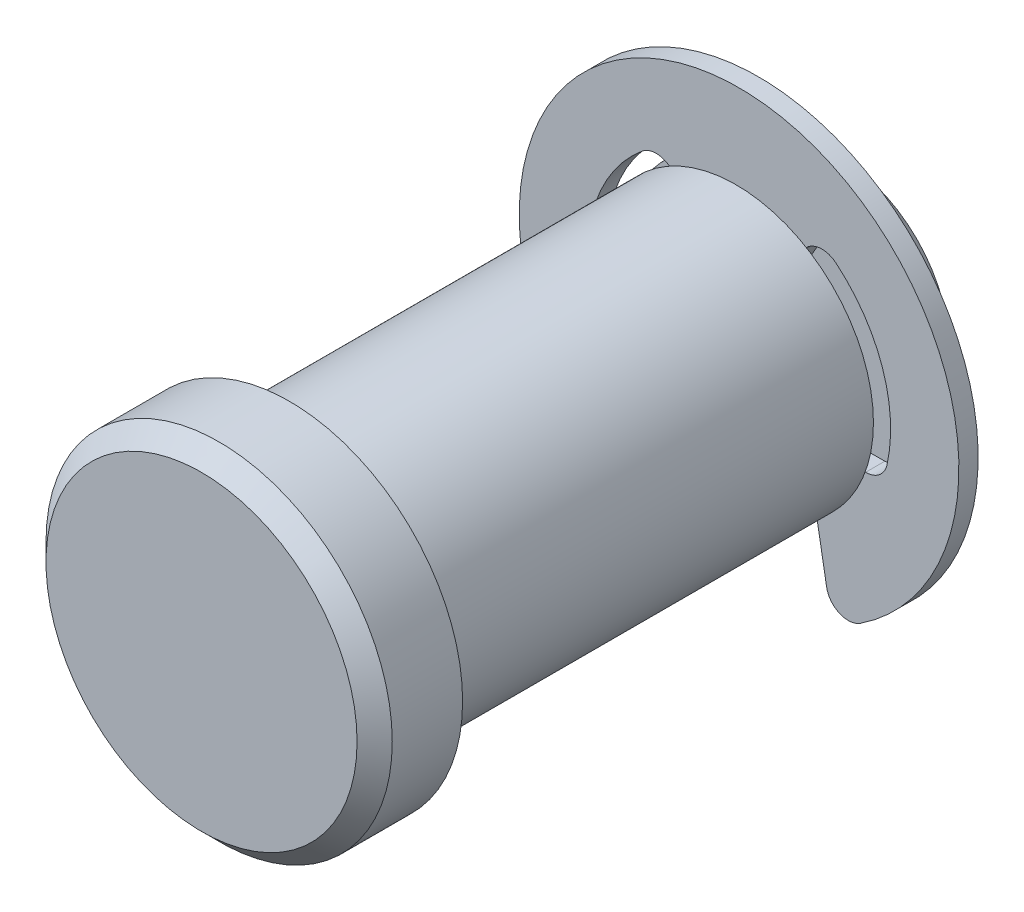
ISO-10303-21;
HEADER;
FILE_DESCRIPTION(('STEP AP214'),'2;1');
FILE_NAME('part.step','',(''),(''),'','','');
FILE_SCHEMA(('AUTOMOTIVE_DESIGN { 1 0 10303 214 1 1 1 1 }'));
ENDSEC;
DATA;
#1=APPLICATION_CONTEXT('core data for automotive mechanical design processes');
#2=APPLICATION_PROTOCOL_DEFINITION('international standard','automotive_design',2000,#1);
#3=PRODUCT_CONTEXT('',#1,'mechanical');
#4=PRODUCT('Part','Part','',(#3));
#5=PRODUCT_RELATED_PRODUCT_CATEGORY('part','',(#4));
#6=PRODUCT_DEFINITION_FORMATION('','',#4);
#7=PRODUCT_DEFINITION_CONTEXT('part definition',#1,'design');
#8=PRODUCT_DEFINITION('design','',#6,#7);
#9=PRODUCT_DEFINITION_SHAPE('','',#8);
#10=(LENGTH_UNIT() NAMED_UNIT(*) SI_UNIT(.MILLI.,.METRE.));
#11=(NAMED_UNIT(*) PLANE_ANGLE_UNIT() SI_UNIT($,.RADIAN.));
#12=(NAMED_UNIT(*) SI_UNIT($,.STERADIAN.) SOLID_ANGLE_UNIT());
#13=UNCERTAINTY_MEASURE_WITH_UNIT(LENGTH_MEASURE(1.E-05),#10,'distance_accuracy_value','');
#14=(GEOMETRIC_REPRESENTATION_CONTEXT(3) GLOBAL_UNCERTAINTY_ASSIGNED_CONTEXT((#13)) GLOBAL_UNIT_ASSIGNED_CONTEXT((#10,
#11,#12)) REPRESENTATION_CONTEXT('',''));
#15=CARTESIAN_POINT('',(0.,0.,0.));
#16=DIRECTION('',(0.,0.,1.));
#17=DIRECTION('',(1.,0.,0.));
#18=AXIS2_PLACEMENT_3D('',#15,#16,#17);
#19=CARTESIAN_POINT('',(0.,0.,-8.0772));
#20=DIRECTION('',(0.,0.,1.));
#21=DIRECTION('',(1.,0.,0.));
#22=AXIS2_PLACEMENT_3D('',#19,#20,#21);
#23=PLANE('',#22);
#24=DIRECTION('',(-0.173648177666931,0.984807753012208,0.));
#25=VECTOR('',#24,1.);
#26=CARTESIAN_POINT('',(2.59081415555905,0.456830437626479,-8.0772));
#27=LINE('',#26,#25);
#28=CARTESIAN_POINT('',(4.0469110197991,-7.80110523614049,-8.0772));
#29=VERTEX_POINT('',#28);
#30=CARTESIAN_POINT('',(3.07848,-2.30886,-8.0772));
#31=VERTEX_POINT('',#30);
#32=EDGE_CURVE('E203',#29,#31,#27,.T.);
#33=ORIENTED_EDGE('',*,*,#32,.F.);
#34=CARTESIAN_POINT('',(5.04747569685951,-7.62467868763089,-8.0772));
#35=DIRECTION('',(0.,0.,1.));
#36=DIRECTION('',(1.,0.,0.));
#37=AXIS2_PLACEMENT_3D('',#34,#35,#36);
#38=CIRCLE('',#37,1.016);
#39=CARTESIAN_POINT('',(5.6083063298439,-8.47186520847876,-8.0772));
#40=VERTEX_POINT('',#39);
#41=EDGE_CURVE('E257',#29,#40,#38,.T.);
#42=ORIENTED_EDGE('',*,*,#41,.T.);
#43=CARTESIAN_POINT('',(0.,0.,-8.0772));
#44=DIRECTION('',(0.,0.,1.));
#45=DIRECTION('',(1.,0.,0.));
#46=AXIS2_PLACEMENT_3D('',#43,#44,#45);
#47=CIRCLE('',#46,10.16);
#48=CARTESIAN_POINT('',(-5.6083063298439,-8.47186520847876,-8.0772));
#49=VERTEX_POINT('',#48);
#50=EDGE_CURVE('E183',#40,#49,#47,.T.);
#51=ORIENTED_EDGE('',*,*,#50,.T.);
#52=CARTESIAN_POINT('',(-5.04747569685951,-7.62467868763089,-8.0772));
#53=DIRECTION('',(0.,0.,1.));
#54=DIRECTION('',(1.,0.,0.));
#55=AXIS2_PLACEMENT_3D('',#52,#53,#54);
#56=CIRCLE('',#55,1.016);
#57=CARTESIAN_POINT('',(-4.0469110197991,-7.80110523614049,-8.0772));
#58=VERTEX_POINT('',#57);
#59=EDGE_CURVE('E255',#49,#58,#56,.T.);
#60=ORIENTED_EDGE('',*,*,#59,.T.);
#61=DIRECTION('',(-0.173648177666931,-0.984807753012208,0.));
#62=VECTOR('',#61,1.);
#63=CARTESIAN_POINT('',(-2.59081415555905,0.456830437626479,-8.0772));
#64=LINE('',#63,#62);
#65=CARTESIAN_POINT('',(-3.07848,-2.30886,-8.0772));
#66=VERTEX_POINT('',#65);
#67=EDGE_CURVE('E199',#66,#58,#64,.T.);
#68=ORIENTED_EDGE('',*,*,#67,.F.);
#69=DIRECTION('',(1.,0.,0.));
#70=VECTOR('',#69,1.);
#71=CARTESIAN_POINT('',(0.,-2.30886,-8.0772));
#72=LINE('',#71,#70);
#73=CARTESIAN_POINT('',(-5.84681587044607,-2.30886,-8.0772));
#74=VERTEX_POINT('',#73);
#75=EDGE_CURVE('E190',#74,#66,#72,.T.);
#76=ORIENTED_EDGE('',*,*,#75,.F.);
#77=CARTESIAN_POINT('',(-5.84681587044607,-1.29286,-8.0772));
#78=DIRECTION('',(0.,0.,1.));
#79=DIRECTION('',(1.,0.,0.));
#80=AXIS2_PLACEMENT_3D('',#77,#78,#79);
#81=CIRCLE('',#80,1.016);
#82=CARTESIAN_POINT('',(-6.83885249745706,-1.51222118769883,-8.0772));
#83=VERTEX_POINT('',#82);
#84=EDGE_CURVE('E55',#74,#83,#81,.F.);
#85=ORIENTED_EDGE('',*,*,#84,.T.);
#86=CARTESIAN_POINT('',(0.,0.,-8.0772));
#87=DIRECTION('',(0.,0.,1.));
#88=DIRECTION('',(1.,0.,0.));
#89=AXIS2_PLACEMENT_3D('',#86,#87,#88);
#90=CIRCLE('',#89,7.00405);
#91=CARTESIAN_POINT('',(-4.48042061519979,5.38354414056324,-8.0772));
#92=VERTEX_POINT('',#91);
#93=EDGE_CURVE('E215',#92,#83,#90,.T.);
#94=ORIENTED_EDGE('',*,*,#93,.F.);
#95=CARTESIAN_POINT('',(-3.83049559395594,4.60261298690039,-8.0772));
#96=DIRECTION('',(0.,0.,1.));
#97=DIRECTION('',(1.,0.,0.));
#98=AXIS2_PLACEMENT_3D('',#95,#96,#97);
#99=CIRCLE('',#98,1.016);
#100=CARTESIAN_POINT('',(-2.95061378371095,5.11061298690039,-8.0772));
#101=VERTEX_POINT('',#100);
#102=EDGE_CURVE('E187',#92,#101,#99,.F.);
#103=ORIENTED_EDGE('',*,*,#102,.T.);
#104=DIRECTION('',(-0.500000000000001,0.866025403784438,0.));
#105=VECTOR('',#104,1.);
#106=CARTESIAN_POINT('',(0.,0.,-8.0772));
#107=LINE('',#106,#105);
#108=CARTESIAN_POINT('',(-1.92405000000001,3.33255235630289,-8.0772));
#109=VERTEX_POINT('',#108);
#110=EDGE_CURVE('E179',#109,#101,#107,.T.);
#111=ORIENTED_EDGE('',*,*,#110,.F.);
#112=DIRECTION('',(1.,0.,0.));
#113=VECTOR('',#112,1.);
#114=CARTESIAN_POINT('',(-1.92405000000001,3.33255235630289,-8.0772));
#115=LINE('',#114,#113);
#116=CARTESIAN_POINT('',(1.92405000000001,3.33255235630289,-8.0772));
#117=VERTEX_POINT('',#116);
#118=EDGE_CURVE('E163',#109,#117,#115,.T.);
#119=ORIENTED_EDGE('',*,*,#118,.T.);
#120=DIRECTION('',(-0.500000000000001,-0.866025403784438,0.));
#121=VECTOR('',#120,1.);
#122=CARTESIAN_POINT('',(0.,0.,-8.0772));
#123=LINE('',#122,#121);
#124=CARTESIAN_POINT('',(2.95061378371095,5.11061298690039,-8.0772));
#125=VERTEX_POINT('',#124);
#126=EDGE_CURVE('E213',#125,#117,#123,.T.);
#127=ORIENTED_EDGE('',*,*,#126,.F.);
#128=CARTESIAN_POINT('',(3.83049559395594,4.60261298690039,-8.0772));
#129=DIRECTION('',(0.,0.,1.));
#130=DIRECTION('',(1.,0.,0.));
#131=AXIS2_PLACEMENT_3D('',#128,#129,#130);
#132=CIRCLE('',#131,1.016);
#133=CARTESIAN_POINT('',(4.48042061519979,5.38354414056324,-8.0772));
#134=VERTEX_POINT('',#133);
#135=EDGE_CURVE('E272',#125,#134,#132,.F.);
#136=ORIENTED_EDGE('',*,*,#135,.T.);
#137=CARTESIAN_POINT('',(0.,0.,-8.0772));
#138=DIRECTION('',(0.,0.,1.));
#139=DIRECTION('',(1.,0.,0.));
#140=AXIS2_PLACEMENT_3D('',#137,#138,#139);
#141=CIRCLE('',#140,7.00405);
#142=CARTESIAN_POINT('',(6.83885249745706,-1.51222118769883,-8.0772));
#143=VERTEX_POINT('',#142);
#144=EDGE_CURVE('E218',#143,#134,#141,.T.);
#145=ORIENTED_EDGE('',*,*,#144,.F.);
#146=CARTESIAN_POINT('',(5.84681587044607,-1.29286,-8.0772));
#147=DIRECTION('',(0.,0.,1.));
#148=DIRECTION('',(1.,0.,0.));
#149=AXIS2_PLACEMENT_3D('',#146,#147,#148);
#150=CIRCLE('',#149,1.016);
#151=CARTESIAN_POINT('',(5.84681587044607,-2.30886,-8.0772));
#152=VERTEX_POINT('',#151);
#153=EDGE_CURVE('E268',#143,#152,#150,.F.);
#154=ORIENTED_EDGE('',*,*,#153,.T.);
#155=DIRECTION('',(1.,0.,0.));
#156=VECTOR('',#155,1.);
#157=CARTESIAN_POINT('',(0.,-2.30886,-8.0772));
#158=LINE('',#157,#156);
#159=EDGE_CURVE('E208',#31,#152,#158,.T.);
#160=ORIENTED_EDGE('',*,*,#159,.F.);
#161=EDGE_LOOP('',(#33,#42,#51,#60,#68,#76,#85,#94,#103,#111,#119,#127,#136,#145,#154,#160));
#162=FACE_BOUND('',#161,.T.);
#163=ADVANCED_FACE('F47',(#162),#23,.T.);
#164=CARTESIAN_POINT('',(0.,0.,-8.9662));
#165=DIRECTION('',(0.,0.,1.));
#166=DIRECTION('',(1.,0.,0.));
#167=AXIS2_PLACEMENT_3D('',#164,#165,#166);
#168=PLANE('',#167);
#169=CARTESIAN_POINT('',(0.,0.,-8.9662));
#170=DIRECTION('',(0.,0.,1.));
#171=DIRECTION('',(1.,0.,0.));
#172=AXIS2_PLACEMENT_3D('',#169,#170,#171);
#173=CIRCLE('',#172,10.16);
#174=CARTESIAN_POINT('',(5.6083063298439,-8.47186520847876,-8.9662));
#175=VERTEX_POINT('',#174);
#176=CARTESIAN_POINT('',(-5.6083063298439,-8.47186520847876,-8.9662));
#177=VERTEX_POINT('',#176);
#178=EDGE_CURVE('E221',#175,#177,#173,.T.);
#179=ORIENTED_EDGE('',*,*,#178,.F.);
#180=CARTESIAN_POINT('',(5.04747569685951,-7.62467868763089,-8.9662));
#181=DIRECTION('',(0.,0.,1.));
#182=DIRECTION('',(1.,0.,0.));
#183=AXIS2_PLACEMENT_3D('',#180,#181,#182);
#184=CIRCLE('',#183,1.016);
#185=CARTESIAN_POINT('',(4.0469110197991,-7.80110523614049,-8.9662));
#186=VERTEX_POINT('',#185);
#187=EDGE_CURVE('E265',#175,#186,#184,.F.);
#188=ORIENTED_EDGE('',*,*,#187,.T.);
#189=DIRECTION('',(-0.173648177666931,0.984807753012208,0.));
#190=VECTOR('',#189,1.);
#191=CARTESIAN_POINT('',(2.59081415555905,0.456830437626479,-8.9662));
#192=LINE('',#191,#190);
#193=CARTESIAN_POINT('',(3.07848,-2.30886,-8.9662));
#194=VERTEX_POINT('',#193);
#195=EDGE_CURVE('E201',#186,#194,#192,.T.);
#196=ORIENTED_EDGE('',*,*,#195,.T.);
#197=DIRECTION('',(1.,0.,0.));
#198=VECTOR('',#197,1.);
#199=CARTESIAN_POINT('',(0.,-2.30886,-8.9662));
#200=LINE('',#199,#198);
#201=CARTESIAN_POINT('',(5.84681587044607,-2.30886,-8.9662));
#202=VERTEX_POINT('',#201);
#203=EDGE_CURVE('E205',#194,#202,#200,.T.);
#204=ORIENTED_EDGE('',*,*,#203,.T.);
#205=CARTESIAN_POINT('',(5.84681587044607,-1.29286,-8.9662));
#206=DIRECTION('',(0.,0.,1.));
#207=DIRECTION('',(1.,0.,0.));
#208=AXIS2_PLACEMENT_3D('',#205,#206,#207);
#209=CIRCLE('',#208,1.016);
#210=CARTESIAN_POINT('',(6.83885249745706,-1.51222118769883,-8.9662));
#211=VERTEX_POINT('',#210);
#212=EDGE_CURVE('E270',#202,#211,#209,.T.);
#213=ORIENTED_EDGE('',*,*,#212,.T.);
#214=CARTESIAN_POINT('',(0.,0.,-8.9662));
#215=DIRECTION('',(0.,0.,1.));
#216=DIRECTION('',(1.,0.,0.));
#217=AXIS2_PLACEMENT_3D('',#214,#215,#216);
#218=CIRCLE('',#217,7.00405);
#219=CARTESIAN_POINT('',(4.48042061519979,5.38354414056324,-8.9662));
#220=VERTEX_POINT('',#219);
#221=EDGE_CURVE('E229',#211,#220,#218,.T.);
#222=ORIENTED_EDGE('',*,*,#221,.T.);
#223=CARTESIAN_POINT('',(3.83049559395594,4.60261298690039,-8.9662));
#224=DIRECTION('',(0.,0.,1.));
#225=DIRECTION('',(1.,0.,0.));
#226=AXIS2_PLACEMENT_3D('',#223,#224,#225);
#227=CIRCLE('',#226,1.016);
#228=CARTESIAN_POINT('',(2.95061378371095,5.11061298690039,-8.9662));
#229=VERTEX_POINT('',#228);
#230=EDGE_CURVE('E274',#220,#229,#227,.T.);
#231=ORIENTED_EDGE('',*,*,#230,.T.);
#232=DIRECTION('',(-0.500000000000001,-0.866025403784438,0.));
#233=VECTOR('',#232,1.);
#234=CARTESIAN_POINT('',(0.,0.,-8.9662));
#235=LINE('',#234,#233);
#236=CARTESIAN_POINT('',(1.92405,3.33255235630289,-8.9662));
#237=VERTEX_POINT('',#236);
#238=EDGE_CURVE('E211',#229,#237,#235,.T.);
#239=ORIENTED_EDGE('',*,*,#238,.T.);
#240=DIRECTION('',(-1.,0.,0.));
#241=VECTOR('',#240,1.);
#242=CARTESIAN_POINT('',(-1.92405000000001,3.33255235630289,-8.9662));
#243=LINE('',#242,#241);
#244=CARTESIAN_POINT('',(-1.92405000000001,3.33255235630289,-8.9662));
#245=VERTEX_POINT('',#244);
#246=EDGE_CURVE('E174',#237,#245,#243,.T.);
#247=ORIENTED_EDGE('',*,*,#246,.T.);
#248=DIRECTION('',(-0.500000000000001,0.866025403784438,0.));
#249=VECTOR('',#248,1.);
#250=CARTESIAN_POINT('',(0.,0.,-8.9662));
#251=LINE('',#250,#249);
#252=CARTESIAN_POINT('',(-2.95061378371095,5.11061298690039,-8.9662));
#253=VERTEX_POINT('',#252);
#254=EDGE_CURVE('E182',#245,#253,#251,.T.);
#255=ORIENTED_EDGE('',*,*,#254,.T.);
#256=CARTESIAN_POINT('',(-3.83049559395594,4.60261298690039,-8.9662));
#257=DIRECTION('',(0.,0.,1.));
#258=DIRECTION('',(1.,0.,0.));
#259=AXIS2_PLACEMENT_3D('',#256,#257,#258);
#260=CIRCLE('',#259,1.016);
#261=CARTESIAN_POINT('',(-4.48042061519979,5.38354414056324,-8.9662));
#262=VERTEX_POINT('',#261);
#263=EDGE_CURVE('E277',#253,#262,#260,.T.);
#264=ORIENTED_EDGE('',*,*,#263,.T.);
#265=CARTESIAN_POINT('',(0.,0.,-8.9662));
#266=DIRECTION('',(0.,0.,1.));
#267=DIRECTION('',(1.,0.,0.));
#268=AXIS2_PLACEMENT_3D('',#265,#266,#267);
#269=CIRCLE('',#268,7.00405);
#270=CARTESIAN_POINT('',(-6.83885249745706,-1.51222118769883,-8.9662));
#271=VERTEX_POINT('',#270);
#272=EDGE_CURVE('E226',#262,#271,#269,.T.);
#273=ORIENTED_EDGE('',*,*,#272,.T.);
#274=CARTESIAN_POINT('',(-5.84681587044607,-1.29286,-8.9662));
#275=DIRECTION('',(0.,0.,1.));
#276=DIRECTION('',(1.,0.,0.));
#277=AXIS2_PLACEMENT_3D('',#274,#275,#276);
#278=CIRCLE('',#277,1.016);
#279=CARTESIAN_POINT('',(-5.84681587044607,-2.30886,-8.9662));
#280=VERTEX_POINT('',#279);
#281=EDGE_CURVE('E13',#271,#280,#278,.T.);
#282=ORIENTED_EDGE('',*,*,#281,.T.);
#283=DIRECTION('',(1.,0.,0.));
#284=VECTOR('',#283,1.);
#285=CARTESIAN_POINT('',(0.,-2.30886,-8.9662));
#286=LINE('',#285,#284);
#287=CARTESIAN_POINT('',(-3.07848,-2.30886,-8.9662));
#288=VERTEX_POINT('',#287);
#289=EDGE_CURVE('E188',#280,#288,#286,.T.);
#290=ORIENTED_EDGE('',*,*,#289,.T.);
#291=DIRECTION('',(-0.173648177666931,-0.984807753012208,0.));
#292=VECTOR('',#291,1.);
#293=CARTESIAN_POINT('',(-2.59081415555905,0.456830437626479,-8.9662));
#294=LINE('',#293,#292);
#295=CARTESIAN_POINT('',(-4.0469110197991,-7.80110523614049,-8.9662));
#296=VERTEX_POINT('',#295);
#297=EDGE_CURVE('E197',#288,#296,#294,.T.);
#298=ORIENTED_EDGE('',*,*,#297,.T.);
#299=CARTESIAN_POINT('',(-5.04747569685951,-7.62467868763089,-8.9662));
#300=DIRECTION('',(0.,0.,1.));
#301=DIRECTION('',(1.,0.,0.));
#302=AXIS2_PLACEMENT_3D('',#299,#300,#301);
#303=CIRCLE('',#302,1.016);
#304=EDGE_CURVE('E69',#296,#177,#303,.F.);
#305=ORIENTED_EDGE('',*,*,#304,.T.);
#306=EDGE_LOOP('',(#179,#188,#196,#204,#213,#222,#231,#239,#247,#255,#264,#273,#282,#290,#298,#305));
#307=FACE_BOUND('',#306,.T.);
#308=ADVANCED_FACE('F290',(#307),#168,.F.);
#309=CARTESIAN_POINT('',(0.,0.,-8.0772));
#310=DIRECTION('',(0.,0.,-1.));
#311=DIRECTION('',(-1.,0.,0.));
#312=AXIS2_PLACEMENT_3D('',#309,#310,#311);
#313=CYLINDRICAL_SURFACE('',#312,10.16);
#314=ORIENTED_EDGE('',*,*,#50,.F.);
#315=DIRECTION('',(0.,0.,-1.));
#316=VECTOR('',#315,1.);
#317=CARTESIAN_POINT('',(5.6083063298439,-8.47186520847876,-8.0772));
#318=LINE('',#317,#316);
#319=EDGE_CURVE('E262',#40,#175,#318,.T.);
#320=ORIENTED_EDGE('',*,*,#319,.T.);
#321=ORIENTED_EDGE('',*,*,#178,.T.);
#322=DIRECTION('',(0.,0.,-1.));
#323=VECTOR('',#322,1.);
#324=CARTESIAN_POINT('',(-5.6083063298439,-8.47186520847876,-8.0772));
#325=LINE('',#324,#323);
#326=EDGE_CURVE('E259',#177,#49,#325,.F.);
#327=ORIENTED_EDGE('',*,*,#326,.T.);
#328=EDGE_LOOP('',(#314,#320,#321,#327));
#329=FACE_BOUND('',#328,.T.);
#330=ADVANCED_FACE('F330',(#329),#313,.T.);
#331=CARTESIAN_POINT('',(-3.07848,-2.30886,-12.7));
#332=DIRECTION('',(-0.984807753012208,0.173648177666931,0.));
#333=DIRECTION('',(-0.173648177666931,-0.984807753012208,0.));
#334=AXIS2_PLACEMENT_3D('',#331,#332,#333);
#335=PLANE('',#334);
#336=ORIENTED_EDGE('',*,*,#67,.T.);
#337=DIRECTION('',(0.,0.,-1.));
#338=VECTOR('',#337,1.);
#339=CARTESIAN_POINT('',(-4.0469110197991,-7.80110523614049,-12.7));
#340=LINE('',#339,#338);
#341=EDGE_CURVE('E62',#58,#296,#340,.T.);
#342=ORIENTED_EDGE('',*,*,#341,.T.);
#343=ORIENTED_EDGE('',*,*,#297,.F.);
#344=DIRECTION('',(0.,0.,1.));
#345=VECTOR('',#344,1.);
#346=CARTESIAN_POINT('',(-3.07848,-2.30886,-12.7));
#347=LINE('',#346,#345);
#348=EDGE_CURVE('E295',#288,#66,#347,.T.);
#349=ORIENTED_EDGE('',*,*,#348,.T.);
#350=EDGE_LOOP('',(#336,#342,#343,#349));
#351=FACE_BOUND('',#350,.T.);
#352=ADVANCED_FACE('F335',(#351),#335,.F.);
#353=CARTESIAN_POINT('',(-3.50202500000001,6.06568522937639,-12.7));
#354=DIRECTION('',(0.866025403784438,0.500000000000001,0.));
#355=DIRECTION('',(-0.500000000000001,0.866025403784438,0.));
#356=AXIS2_PLACEMENT_3D('',#353,#354,#355);
#357=PLANE('',#356);
#358=ORIENTED_EDGE('',*,*,#110,.T.);
#359=DIRECTION('',(0.,0.,-1.));
#360=VECTOR('',#359,1.);
#361=CARTESIAN_POINT('',(-2.95061378371095,5.11061298690039,-8.9662));
#362=LINE('',#361,#360);
#363=EDGE_CURVE('E247',#101,#253,#362,.T.);
#364=ORIENTED_EDGE('',*,*,#363,.T.);
#365=ORIENTED_EDGE('',*,*,#254,.F.);
#366=DIRECTION('',(0.,0.,-1.));
#367=VECTOR('',#366,1.);
#368=CARTESIAN_POINT('',(-1.92405,3.33255235630289,-8.0772));
#369=LINE('',#368,#367);
#370=EDGE_CURVE('E167',#245,#109,#369,.F.);
#371=ORIENTED_EDGE('',*,*,#370,.T.);
#372=EDGE_LOOP('',(#358,#364,#365,#371));
#373=FACE_BOUND('',#372,.T.);
#374=ADVANCED_FACE('F178',(#373),#357,.F.);
#375=CARTESIAN_POINT('',(0.,0.,-12.7));
#376=DIRECTION('',(0.,0.,1.));
#377=DIRECTION('',(1.,0.,0.));
#378=AXIS2_PLACEMENT_3D('',#375,#376,#377);
#379=CYLINDRICAL_SURFACE('',#378,7.00405);
#380=ORIENTED_EDGE('',*,*,#272,.F.);
#381=DIRECTION('',(0.,0.,1.));
#382=VECTOR('',#381,1.);
#383=CARTESIAN_POINT('',(-4.48042061519979,5.38354414056324,-12.7));
#384=LINE('',#383,#382);
#385=EDGE_CURVE('E244',#262,#92,#384,.T.);
#386=ORIENTED_EDGE('',*,*,#385,.T.);
#387=ORIENTED_EDGE('',*,*,#93,.T.);
#388=DIRECTION('',(0.,0.,1.));
#389=VECTOR('',#388,1.);
#390=CARTESIAN_POINT('',(-6.83885249745706,-1.51222118769883,-12.7));
#391=LINE('',#390,#389);
#392=EDGE_CURVE('E242',#83,#271,#391,.F.);
#393=ORIENTED_EDGE('',*,*,#392,.T.);
#394=EDGE_LOOP('',(#380,#386,#387,#393));
#395=FACE_BOUND('',#394,.T.);
#396=ADVANCED_FACE('F285',(#395),#379,.F.);
#397=CARTESIAN_POINT('',(-6.61255486955685,-2.30886,-12.7));
#398=DIRECTION('',(0.,-1.,0.));
#399=DIRECTION('',(0.,0.,-1.));
#400=AXIS2_PLACEMENT_3D('',#397,#398,#399);
#401=PLANE('',#400);
#402=ORIENTED_EDGE('',*,*,#289,.F.);
#403=DIRECTION('',(0.,0.,-1.));
#404=VECTOR('',#403,1.);
#405=CARTESIAN_POINT('',(-5.84681587044607,-2.30886,-8.0772));
#406=LINE('',#405,#404);
#407=EDGE_CURVE('E249',#280,#74,#406,.F.);
#408=ORIENTED_EDGE('',*,*,#407,.T.);
#409=ORIENTED_EDGE('',*,*,#75,.T.);
#410=ORIENTED_EDGE('',*,*,#348,.F.);
#411=EDGE_LOOP('',(#402,#408,#409,#410));
#412=FACE_BOUND('',#411,.T.);
#413=ADVANCED_FACE('F293',(#412),#401,.F.);
#414=CARTESIAN_POINT('',(0.,0.,-12.7));
#415=DIRECTION('',(0.,0.,1.));
#416=DIRECTION('',(1.,0.,0.));
#417=AXIS2_PLACEMENT_3D('',#414,#415,#416);
#418=CYLINDRICAL_SURFACE('',#417,7.00405);
#419=ORIENTED_EDGE('',*,*,#221,.F.);
#420=DIRECTION('',(0.,0.,1.));
#421=VECTOR('',#420,1.);
#422=CARTESIAN_POINT('',(6.83885249745706,-1.51222118769883,-12.7));
#423=LINE('',#422,#421);
#424=EDGE_CURVE('E234',#211,#143,#423,.T.);
#425=ORIENTED_EDGE('',*,*,#424,.T.);
#426=ORIENTED_EDGE('',*,*,#144,.T.);
#427=DIRECTION('',(0.,0.,1.));
#428=VECTOR('',#427,1.);
#429=CARTESIAN_POINT('',(4.48042061519979,5.38354414056324,-12.7));
#430=LINE('',#429,#428);
#431=EDGE_CURVE('E232',#134,#220,#430,.F.);
#432=ORIENTED_EDGE('',*,*,#431,.T.);
#433=EDGE_LOOP('',(#419,#425,#426,#432));
#434=FACE_BOUND('',#433,.T.);
#435=ADVANCED_FACE('F309',(#434),#418,.F.);
#436=CARTESIAN_POINT('',(3.07848,-2.30886,-12.7));
#437=DIRECTION('',(0.,-1.,0.));
#438=DIRECTION('',(0.,0.,-1.));
#439=AXIS2_PLACEMENT_3D('',#436,#437,#438);
#440=PLANE('',#439);
#441=ORIENTED_EDGE('',*,*,#159,.T.);
#442=DIRECTION('',(0.,0.,-1.));
#443=VECTOR('',#442,1.);
#444=CARTESIAN_POINT('',(5.84681587044607,-2.30886,-8.9662));
#445=LINE('',#444,#443);
#446=EDGE_CURVE('E237',#152,#202,#445,.T.);
#447=ORIENTED_EDGE('',*,*,#446,.T.);
#448=ORIENTED_EDGE('',*,*,#203,.F.);
#449=DIRECTION('',(0.,0.,1.));
#450=VECTOR('',#449,1.);
#451=CARTESIAN_POINT('',(3.07848,-2.30886,-12.7));
#452=LINE('',#451,#450);
#453=EDGE_CURVE('E192',#194,#31,#452,.T.);
#454=ORIENTED_EDGE('',*,*,#453,.T.);
#455=EDGE_LOOP('',(#441,#447,#448,#454));
#456=FACE_BOUND('',#455,.T.);
#457=ADVANCED_FACE('F319',(#456),#440,.F.);
#458=CARTESIAN_POINT('',(3.07848,-2.30886,-12.7));
#459=DIRECTION('',(0.984807753012208,0.173648177666931,0.));
#460=DIRECTION('',(-0.173648177666931,0.984807753012208,0.));
#461=AXIS2_PLACEMENT_3D('',#458,#459,#460);
#462=PLANE('',#461);
#463=ORIENTED_EDGE('',*,*,#195,.F.);
#464=DIRECTION('',(0.,0.,-1.));
#465=VECTOR('',#464,1.);
#466=CARTESIAN_POINT('',(4.0469110197991,-7.80110523614049,-12.7));
#467=LINE('',#466,#465);
#468=EDGE_CURVE('E252',#186,#29,#467,.F.);
#469=ORIENTED_EDGE('',*,*,#468,.T.);
#470=ORIENTED_EDGE('',*,*,#32,.T.);
#471=ORIENTED_EDGE('',*,*,#453,.F.);
#472=EDGE_LOOP('',(#463,#469,#470,#471));
#473=FACE_BOUND('',#472,.T.);
#474=ADVANCED_FACE('F324',(#473),#462,.F.);
#475=CARTESIAN_POINT('',(0.,0.,-12.7));
#476=DIRECTION('',(-0.866025403784438,0.500000000000001,0.));
#477=DIRECTION('',(-0.500000000000001,-0.866025403784438,0.));
#478=AXIS2_PLACEMENT_3D('',#475,#476,#477);
#479=PLANE('',#478);
#480=ORIENTED_EDGE('',*,*,#238,.F.);
#481=DIRECTION('',(0.,0.,-1.));
#482=VECTOR('',#481,1.);
#483=CARTESIAN_POINT('',(2.95061378371095,5.11061298690039,-8.0772));
#484=LINE('',#483,#482);
#485=EDGE_CURVE('E239',#229,#125,#484,.F.);
#486=ORIENTED_EDGE('',*,*,#485,.T.);
#487=ORIENTED_EDGE('',*,*,#126,.T.);
#488=DIRECTION('',(0.,0.,-1.));
#489=VECTOR('',#488,1.);
#490=CARTESIAN_POINT('',(1.92405,3.33255235630289,-8.0772));
#491=LINE('',#490,#489);
#492=EDGE_CURVE('E170',#117,#237,#491,.T.);
#493=ORIENTED_EDGE('',*,*,#492,.T.);
#494=EDGE_LOOP('',(#480,#486,#487,#493));
#495=FACE_BOUND('',#494,.T.);
#496=ADVANCED_FACE('F302',(#495),#479,.F.);
#497=CARTESIAN_POINT('',(-1.92405000000001,3.33255235630289,-12.8486815495919));
#498=DIRECTION('',(0.,-1.,0.));
#499=DIRECTION('',(0.,0.,-1.));
#500=AXIS2_PLACEMENT_3D('',#497,#498,#499);
#501=PLANE('',#500);
#502=ORIENTED_EDGE('',*,*,#246,.F.);
#503=ORIENTED_EDGE('',*,*,#492,.F.);
#504=ORIENTED_EDGE('',*,*,#118,.F.);
#505=ORIENTED_EDGE('',*,*,#370,.F.);
#506=EDGE_LOOP('',(#502,#503,#504,#505));
#507=FACE_BOUND('',#506,.T.);
#508=ADVANCED_FACE('F166',(#507),#501,.T.);
#509=CARTESIAN_POINT('',(5.84681587044607,-1.29286,-12.7));
#510=DIRECTION('',(0.,0.,1.));
#511=DIRECTION('',(1.,0.,0.));
#512=AXIS2_PLACEMENT_3D('',#509,#510,#511);
#513=CYLINDRICAL_SURFACE('',#512,1.016);
#514=ORIENTED_EDGE('',*,*,#212,.F.);
#515=ORIENTED_EDGE('',*,*,#446,.F.);
#516=ORIENTED_EDGE('',*,*,#153,.F.);
#517=ORIENTED_EDGE('',*,*,#424,.F.);
#518=EDGE_LOOP('',(#514,#515,#516,#517));
#519=FACE_BOUND('',#518,.T.);
#520=ADVANCED_FACE('F315',(#519),#513,.F.);
#521=CARTESIAN_POINT('',(3.83049559395594,4.60261298690039,-12.7));
#522=DIRECTION('',(0.,0.,1.));
#523=DIRECTION('',(1.,0.,0.));
#524=AXIS2_PLACEMENT_3D('',#521,#522,#523);
#525=CYLINDRICAL_SURFACE('',#524,1.016);
#526=ORIENTED_EDGE('',*,*,#230,.F.);
#527=ORIENTED_EDGE('',*,*,#431,.F.);
#528=ORIENTED_EDGE('',*,*,#135,.F.);
#529=ORIENTED_EDGE('',*,*,#485,.F.);
#530=EDGE_LOOP('',(#526,#527,#528,#529));
#531=FACE_BOUND('',#530,.T.);
#532=ADVANCED_FACE('F312',(#531),#525,.F.);
#533=CARTESIAN_POINT('',(-3.83049559395594,4.60261298690039,-12.7));
#534=DIRECTION('',(0.,0.,1.));
#535=DIRECTION('',(1.,0.,0.));
#536=AXIS2_PLACEMENT_3D('',#533,#534,#535);
#537=CYLINDRICAL_SURFACE('',#536,1.016);
#538=ORIENTED_EDGE('',*,*,#263,.F.);
#539=ORIENTED_EDGE('',*,*,#363,.F.);
#540=ORIENTED_EDGE('',*,*,#102,.F.);
#541=ORIENTED_EDGE('',*,*,#385,.F.);
#542=EDGE_LOOP('',(#538,#539,#540,#541));
#543=FACE_BOUND('',#542,.T.);
#544=ADVANCED_FACE('F358',(#543),#537,.F.);
#545=CARTESIAN_POINT('',(-5.84681587044607,-1.29286,-12.7));
#546=DIRECTION('',(0.,0.,1.));
#547=DIRECTION('',(1.,0.,0.));
#548=AXIS2_PLACEMENT_3D('',#545,#546,#547);
#549=CYLINDRICAL_SURFACE('',#548,1.016);
#550=ORIENTED_EDGE('',*,*,#281,.F.);
#551=ORIENTED_EDGE('',*,*,#392,.F.);
#552=ORIENTED_EDGE('',*,*,#84,.F.);
#553=ORIENTED_EDGE('',*,*,#407,.F.);
#554=EDGE_LOOP('',(#550,#551,#552,#553));
#555=FACE_BOUND('',#554,.T.);
#556=ADVANCED_FACE('F288',(#555),#549,.F.);
#557=CARTESIAN_POINT('',(5.04747569685951,-7.62467868763089,-8.0772));
#558=DIRECTION('',(0.,0.,-1.));
#559=DIRECTION('',(-1.,0.,0.));
#560=AXIS2_PLACEMENT_3D('',#557,#558,#559);
#561=CYLINDRICAL_SURFACE('',#560,1.016);
#562=ORIENTED_EDGE('',*,*,#187,.F.);
#563=ORIENTED_EDGE('',*,*,#319,.F.);
#564=ORIENTED_EDGE('',*,*,#41,.F.);
#565=ORIENTED_EDGE('',*,*,#468,.F.);
#566=EDGE_LOOP('',(#562,#563,#564,#565));
#567=FACE_BOUND('',#566,.T.);
#568=ADVANCED_FACE('F333',(#567),#561,.T.);
#569=CARTESIAN_POINT('',(-5.04747569685951,-7.62467868763089,-8.0772));
#570=DIRECTION('',(0.,0.,-1.));
#571=DIRECTION('',(-1.,0.,0.));
#572=AXIS2_PLACEMENT_3D('',#569,#570,#571);
#573=CYLINDRICAL_SURFACE('',#572,1.016);
#574=ORIENTED_EDGE('',*,*,#304,.F.);
#575=ORIENTED_EDGE('',*,*,#341,.F.);
#576=ORIENTED_EDGE('',*,*,#59,.F.);
#577=ORIENTED_EDGE('',*,*,#326,.F.);
#578=EDGE_LOOP('',(#574,#575,#576,#577));
#579=FACE_BOUND('',#578,.T.);
#580=ADVANCED_FACE('F49',(#579),#573,.T.);
#581=CLOSED_SHELL('',(#163,#308,#330,#352,#374,#396,#413,#435,#457,#474,#496,#508,#520,#532,
#544,#556,#568,#580));
#582=MANIFOLD_SOLID_BREP('B2',#581);
#583=CARTESIAN_POINT('',(0.,0.,12.7));
#584=DIRECTION('',(0.,0.,-1.));
#585=DIRECTION('',(-1.,0.,0.));
#586=AXIS2_PLACEMENT_3D('',#583,#584,#585);
#587=CYLINDRICAL_SURFACE('',#586,6.35);
#588=CARTESIAN_POINT('',(0.,0.,12.7));
#589=DIRECTION('',(0.,0.,1.));
#590=DIRECTION('',(1.,0.,0.));
#591=AXIS2_PLACEMENT_3D('',#588,#589,#590);
#592=CIRCLE('',#591,6.35);
#593=CARTESIAN_POINT('',(6.35,0.,12.7));
#594=VERTEX_POINT('',#593);
#595=EDGE_CURVE('E508',#594,#594,#592,.T.);
#596=ORIENTED_EDGE('',*,*,#595,.F.);
#597=EDGE_LOOP('',(#596));
#598=FACE_BOUND('',#597,.T.);
#599=CARTESIAN_POINT('',(0.,0.,-7.9375));
#600=DIRECTION('',(0.,0.,1.));
#601=DIRECTION('',(1.,0.,0.));
#602=AXIS2_PLACEMENT_3D('',#599,#600,#601);
#603=CIRCLE('',#602,6.35);
#604=CARTESIAN_POINT('',(6.35,0.,-7.9375));
#605=VERTEX_POINT('',#604);
#606=EDGE_CURVE('E520',#605,#605,#603,.T.);
#607=ORIENTED_EDGE('',*,*,#606,.T.);
#608=EDGE_LOOP('',(#607));
#609=FACE_BOUND('',#608,.T.);
#610=ADVANCED_FACE('F488',(#598,#609),#587,.T.);
#611=CARTESIAN_POINT('',(0.,6.35,-7.9375));
#612=DIRECTION('',(0.,0.,-1.));
#613=DIRECTION('',(-1.,0.,0.));
#614=AXIS2_PLACEMENT_3D('',#611,#612,#613);
#615=PLANE('',#614);
#616=CARTESIAN_POINT('',(0.,0.,-7.9375));
#617=DIRECTION('',(0.,0.,1.));
#618=DIRECTION('',(1.,0.,0.));
#619=AXIS2_PLACEMENT_3D('',#616,#617,#618);
#620=CIRCLE('',#619,3.8481);
#621=CARTESIAN_POINT('',(3.8481,0.,-7.9375));
#622=VERTEX_POINT('',#621);
#623=EDGE_CURVE('E511',#622,#622,#620,.T.);
#624=ORIENTED_EDGE('',*,*,#623,.T.);
#625=EDGE_LOOP('',(#624));
#626=FACE_BOUND('',#625,.T.);
#627=ORIENTED_EDGE('',*,*,#606,.F.);
#628=EDGE_LOOP('',(#627));
#629=FACE_BOUND('',#628,.T.);
#630=ADVANCED_FACE('F538',(#626,#629),#615,.T.);
#631=CARTESIAN_POINT('',(0.,0.,12.7));
#632=DIRECTION('',(0.,0.,1.));
#633=DIRECTION('',(1.,0.,0.));
#634=AXIS2_PLACEMENT_3D('',#631,#632,#633);
#635=CYLINDRICAL_SURFACE('',#634,3.8481);
#636=CARTESIAN_POINT('',(0.,0.,-9.1059));
#637=DIRECTION('',(0.,0.,1.));
#638=DIRECTION('',(1.,0.,0.));
#639=AXIS2_PLACEMENT_3D('',#636,#637,#638);
#640=CIRCLE('',#639,3.8481);
#641=CARTESIAN_POINT('',(3.8481,0.,-9.1059));
#642=VERTEX_POINT('',#641);
#643=EDGE_CURVE('E514',#642,#642,#640,.T.);
#644=ORIENTED_EDGE('',*,*,#643,.T.);
#645=EDGE_LOOP('',(#644));
#646=FACE_BOUND('',#645,.T.);
#647=ORIENTED_EDGE('',*,*,#623,.F.);
#648=EDGE_LOOP('',(#647));
#649=FACE_BOUND('',#648,.T.);
#650=ADVANCED_FACE('F543',(#646,#649),#635,.T.);
#651=CARTESIAN_POINT('',(0.,6.35,-9.1059));
#652=DIRECTION('',(0.,0.,1.));
#653=DIRECTION('',(1.,0.,0.));
#654=AXIS2_PLACEMENT_3D('',#651,#652,#653);
#655=PLANE('',#654);
#656=CARTESIAN_POINT('',(0.,0.,-9.1059));
#657=DIRECTION('',(0.,0.,1.));
#658=DIRECTION('',(1.,0.,0.));
#659=AXIS2_PLACEMENT_3D('',#656,#657,#658);
#660=CIRCLE('',#659,6.35);
#661=CARTESIAN_POINT('',(6.35,0.,-9.1059));
#662=VERTEX_POINT('',#661);
#663=EDGE_CURVE('E517',#662,#662,#660,.T.);
#664=ORIENTED_EDGE('',*,*,#663,.T.);
#665=EDGE_LOOP('',(#664));
#666=FACE_BOUND('',#665,.T.);
#667=ORIENTED_EDGE('',*,*,#643,.F.);
#668=EDGE_LOOP('',(#667));
#669=FACE_BOUND('',#668,.T.);
#670=ADVANCED_FACE('F549',(#666,#669),#655,.T.);
#671=CARTESIAN_POINT('',(0.,0.,-12.7));
#672=DIRECTION('',(0.,0.,1.));
#673=DIRECTION('',(1.,0.,0.));
#674=AXIS2_PLACEMENT_3D('',#671,#672,#673);
#675=PLANE('',#674);
#676=CARTESIAN_POINT('',(0.,0.,-12.7));
#677=DIRECTION('',(0.,0.,1.));
#678=DIRECTION('',(1.,0.,0.));
#679=AXIS2_PLACEMENT_3D('',#676,#677,#678);
#680=CIRCLE('',#679,5.07999999999999);
#681=CARTESIAN_POINT('',(5.07999999999999,0.,-12.7));
#682=VERTEX_POINT('',#681);
#683=EDGE_CURVE('E46',#682,#682,#680,.F.);
#684=ORIENTED_EDGE('',*,*,#683,.T.);
#685=EDGE_LOOP('',(#684));
#686=FACE_BOUND('',#685,.T.);
#687=ADVANCED_FACE('F554',(#686),#675,.F.);
#688=CARTESIAN_POINT('',(0.,0.,-11.43));
#689=DIRECTION('',(0.,0.,1.));
#690=DIRECTION('',(1.,0.,0.));
#691=AXIS2_PLACEMENT_3D('',#688,#689,#690);
#692=CIRCLE('',#691,6.35);
#693=CARTESIAN_POINT('',(6.35,0.,-11.43));
#694=VERTEX_POINT('',#693);
#695=EDGE_CURVE('E495',#694,#694,#692,.T.);
#696=ORIENTED_EDGE('',*,*,#695,.T.);
#697=EDGE_LOOP('',(#696));
#698=FACE_BOUND('',#697,.T.);
#699=ORIENTED_EDGE('',*,*,#663,.F.);
#700=EDGE_LOOP('',(#699));
#701=FACE_BOUND('',#700,.T.);
#702=ADVANCED_FACE('F532',(#698,#701),#587,.T.);
#703=CARTESIAN_POINT('',(0.,0.,12.7));
#704=DIRECTION('',(0.,0.,1.));
#705=DIRECTION('',(1.,0.,0.));
#706=AXIS2_PLACEMENT_3D('',#703,#704,#705);
#707=PLANE('',#706);
#708=CARTESIAN_POINT('',(0.,0.,12.7));
#709=DIRECTION('',(0.,0.,1.));
#710=DIRECTION('',(1.,0.,0.));
#711=AXIS2_PLACEMENT_3D('',#708,#709,#710);
#712=CIRCLE('',#711,8.001);
#713=CARTESIAN_POINT('',(8.001,0.,12.7));
#714=VERTEX_POINT('',#713);
#715=EDGE_CURVE('E523',#714,#714,#712,.T.);
#716=ORIENTED_EDGE('',*,*,#715,.F.);
#717=EDGE_LOOP('',(#716));
#718=FACE_BOUND('',#717,.T.);
#719=ORIENTED_EDGE('',*,*,#595,.T.);
#720=EDGE_LOOP('',(#719));
#721=FACE_BOUND('',#720,.T.);
#722=ADVANCED_FACE('F529',(#718,#721),#707,.F.);
#723=CARTESIAN_POINT('',(0.,0.,16.764));
#724=DIRECTION('',(0.,0.,-1.));
#725=DIRECTION('',(-1.,0.,0.));
#726=AXIS2_PLACEMENT_3D('',#723,#724,#725);
#727=CYLINDRICAL_SURFACE('',#726,8.001);
#728=CARTESIAN_POINT('',(0.,0.,15.9512));
#729=DIRECTION('',(0.,0.,1.));
#730=DIRECTION('',(1.,0.,0.));
#731=AXIS2_PLACEMENT_3D('',#728,#729,#730);
#732=CIRCLE('',#731,8.001);
#733=CARTESIAN_POINT('',(8.001,0.,15.9512));
#734=VERTEX_POINT('',#733);
#735=EDGE_CURVE('E499',#734,#734,#732,.F.);
#736=ORIENTED_EDGE('',*,*,#735,.T.);
#737=EDGE_LOOP('',(#736));
#738=FACE_BOUND('',#737,.T.);
#739=ORIENTED_EDGE('',*,*,#715,.T.);
#740=EDGE_LOOP('',(#739));
#741=FACE_BOUND('',#740,.T.);
#742=ADVANCED_FACE('F527',(#738,#741),#727,.T.);
#743=CARTESIAN_POINT('',(0.,0.,16.764));
#744=DIRECTION('',(0.,0.,1.));
#745=DIRECTION('',(1.,0.,0.));
#746=AXIS2_PLACEMENT_3D('',#743,#744,#745);
#747=PLANE('',#746);
#748=CARTESIAN_POINT('',(0.,0.,16.764));
#749=DIRECTION('',(0.,0.,1.));
#750=DIRECTION('',(1.,0.,0.));
#751=AXIS2_PLACEMENT_3D('',#748,#749,#750);
#752=CIRCLE('',#751,7.1882);
#753=CARTESIAN_POINT('',(7.1882,0.,16.764));
#754=VERTEX_POINT('',#753);
#755=EDGE_CURVE('E503',#754,#754,#752,.T.);
#756=ORIENTED_EDGE('',*,*,#755,.T.);
#757=EDGE_LOOP('',(#756));
#758=FACE_BOUND('',#757,.T.);
#759=ADVANCED_FACE('F558',(#758),#747,.T.);
#760=CARTESIAN_POINT('',(0.,0.,16.764));
#761=DIRECTION('',(0.,0.,-1.));
#762=DIRECTION('',(-1.,0.,0.));
#763=AXIS2_PLACEMENT_3D('',#760,#761,#762);
#764=CONICAL_SURFACE('',#763,7.1882,0.785398163397447);
#765=ORIENTED_EDGE('',*,*,#735,.F.);
#766=EDGE_LOOP('',(#765));
#767=FACE_BOUND('',#766,.T.);
#768=ORIENTED_EDGE('',*,*,#755,.F.);
#769=EDGE_LOOP('',(#768));
#770=FACE_BOUND('',#769,.T.);
#771=ADVANCED_FACE('F556',(#767,#770),#764,.T.);
#772=CARTESIAN_POINT('',(0.,0.,-11.43));
#773=DIRECTION('',(0.,0.,1.));
#774=DIRECTION('',(1.,0.,0.));
#775=AXIS2_PLACEMENT_3D('',#772,#773,#774);
#776=CONICAL_SURFACE('',#775,6.35,0.785398163397452);
#777=ORIENTED_EDGE('',*,*,#683,.F.);
#778=EDGE_LOOP('',(#777));
#779=FACE_BOUND('',#778,.T.);
#780=ORIENTED_EDGE('',*,*,#695,.F.);
#781=EDGE_LOOP('',(#780));
#782=FACE_BOUND('',#781,.T.);
#783=ADVANCED_FACE('F490',(#779,#782),#776,.T.);
#784=CLOSED_SHELL('',(#610,#630,#650,#670,#687,#702,#722,#742,#759,#771,#783));
#785=MANIFOLD_SOLID_BREP('B7',#784);
#786=ADVANCED_BREP_SHAPE_REPRESENTATION('',(#18,#582,#785),#14);
#787=SHAPE_DEFINITION_REPRESENTATION(#9,#786);
ENDSEC;
END-ISO-10303-21;
